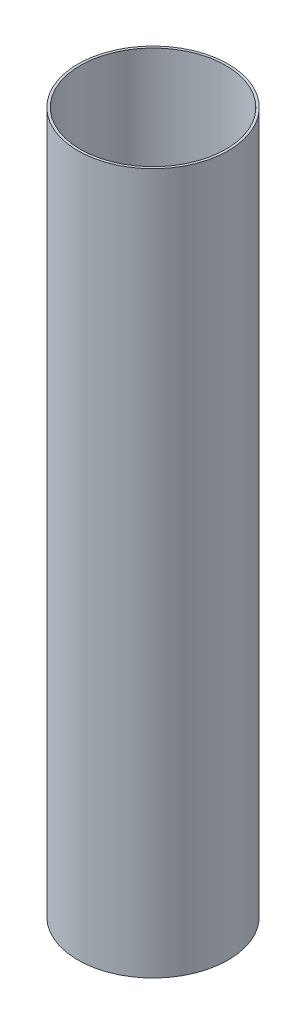
ISO-10303-21;
HEADER;
FILE_DESCRIPTION(('STEP AP214'),'2;1');
FILE_NAME('part.step','',(''),(''),'','','');
FILE_SCHEMA(('AUTOMOTIVE_DESIGN { 1 0 10303 214 1 1 1 1 }'));
ENDSEC;
DATA;
#1=APPLICATION_CONTEXT('core data for automotive mechanical design processes');
#2=APPLICATION_PROTOCOL_DEFINITION('international standard','automotive_design',2000,#1);
#3=PRODUCT_CONTEXT('',#1,'mechanical');
#4=PRODUCT('Part','Part','',(#3));
#5=PRODUCT_RELATED_PRODUCT_CATEGORY('part','',(#4));
#6=PRODUCT_DEFINITION_FORMATION('','',#4);
#7=PRODUCT_DEFINITION_CONTEXT('part definition',#1,'design');
#8=PRODUCT_DEFINITION('design','',#6,#7);
#9=PRODUCT_DEFINITION_SHAPE('','',#8);
#10=(LENGTH_UNIT() NAMED_UNIT(*) SI_UNIT(.MILLI.,.METRE.));
#11=(NAMED_UNIT(*) PLANE_ANGLE_UNIT() SI_UNIT($,.RADIAN.));
#12=(NAMED_UNIT(*) SI_UNIT($,.STERADIAN.) SOLID_ANGLE_UNIT());
#13=UNCERTAINTY_MEASURE_WITH_UNIT(LENGTH_MEASURE(1.E-05),#10,'distance_accuracy_value','');
#14=(GEOMETRIC_REPRESENTATION_CONTEXT(3) GLOBAL_UNCERTAINTY_ASSIGNED_CONTEXT((#13)) GLOBAL_UNIT_ASSIGNED_CONTEXT((#10,
#11,#12)) REPRESENTATION_CONTEXT('',''));
#15=CARTESIAN_POINT('',(0.,0.,0.));
#16=DIRECTION('',(0.,0.,1.));
#17=DIRECTION('',(1.,0.,0.));
#18=AXIS2_PLACEMENT_3D('',#15,#16,#17);
#19=CARTESIAN_POINT('',(0.,948.69,0.));
#20=DIRECTION('',(0.,1.,0.));
#21=DIRECTION('',(0.,0.,1.));
#22=AXIS2_PLACEMENT_3D('',#19,#20,#21);
#23=PLANE('',#22);
#24=CARTESIAN_POINT('',(0.,948.69,0.));
#25=DIRECTION('',(0.,1.,0.));
#26=DIRECTION('',(1.,0.,0.));
#27=AXIS2_PLACEMENT_3D('',#24,#25,#26);
#28=CIRCLE('',#27,101.727);
#29=CARTESIAN_POINT('',(101.727,948.69,0.));
#30=VERTEX_POINT('',#29);
#31=EDGE_CURVE('E11',#30,#30,#28,.T.);
#32=ORIENTED_EDGE('',*,*,#31,.T.);
#33=EDGE_LOOP('',(#32));
#34=FACE_BOUND('',#33,.T.);
#35=CARTESIAN_POINT('',(0.,948.69,0.));
#36=DIRECTION('',(0.,1.,0.));
#37=DIRECTION('',(0.,0.,1.));
#38=AXIS2_PLACEMENT_3D('',#35,#36,#37);
#39=CIRCLE('',#38,98.425);
#40=CARTESIAN_POINT('',(0.,948.69,98.425));
#41=VERTEX_POINT('',#40);
#42=EDGE_CURVE('E54',#41,#41,#39,.T.);
#43=ORIENTED_EDGE('',*,*,#42,.F.);
#44=EDGE_LOOP('',(#43));
#45=FACE_BOUND('',#44,.T.);
#46=ADVANCED_FACE('F43',(#34,#45),#23,.T.);
#47=CARTESIAN_POINT('',(0.,0.,0.));
#48=DIRECTION('',(0.,1.,0.));
#49=DIRECTION('',(0.,0.,1.));
#50=AXIS2_PLACEMENT_3D('',#47,#48,#49);
#51=PLANE('',#50);
#52=CARTESIAN_POINT('',(0.,0.,0.));
#53=DIRECTION('',(0.,1.,0.));
#54=DIRECTION('',(1.,0.,0.));
#55=AXIS2_PLACEMENT_3D('',#52,#53,#54);
#56=CIRCLE('',#55,101.727);
#57=CARTESIAN_POINT('',(101.727,0.,0.));
#58=VERTEX_POINT('',#57);
#59=EDGE_CURVE('E47',#58,#58,#56,.T.);
#60=ORIENTED_EDGE('',*,*,#59,.F.);
#61=EDGE_LOOP('',(#60));
#62=FACE_BOUND('',#61,.T.);
#63=CARTESIAN_POINT('',(0.,0.,0.));
#64=DIRECTION('',(0.,1.,0.));
#65=DIRECTION('',(0.,0.,1.));
#66=AXIS2_PLACEMENT_3D('',#63,#64,#65);
#67=CIRCLE('',#66,98.425);
#68=CARTESIAN_POINT('',(0.,0.,98.425));
#69=VERTEX_POINT('',#68);
#70=EDGE_CURVE('E56',#69,#69,#67,.T.);
#71=ORIENTED_EDGE('',*,*,#70,.T.);
#72=EDGE_LOOP('',(#71));
#73=FACE_BOUND('',#72,.T.);
#74=ADVANCED_FACE('F66',(#62,#73),#51,.F.);
#75=CARTESIAN_POINT('',(0.,948.69,0.));
#76=DIRECTION('',(0.,-1.,0.));
#77=DIRECTION('',(0.,0.,-1.));
#78=AXIS2_PLACEMENT_3D('',#75,#76,#77);
#79=CYLINDRICAL_SURFACE('',#78,101.727);
#80=ORIENTED_EDGE('',*,*,#31,.F.);
#81=EDGE_LOOP('',(#80));
#82=FACE_BOUND('',#81,.T.);
#83=ORIENTED_EDGE('',*,*,#59,.T.);
#84=EDGE_LOOP('',(#83));
#85=FACE_BOUND('',#84,.T.);
#86=ADVANCED_FACE('F45',(#82,#85),#79,.T.);
#87=CARTESIAN_POINT('',(0.,948.69,0.));
#88=DIRECTION('',(0.,-1.,0.));
#89=DIRECTION('',(0.,0.,-1.));
#90=AXIS2_PLACEMENT_3D('',#87,#88,#89);
#91=CYLINDRICAL_SURFACE('',#90,98.425);
#92=ORIENTED_EDGE('',*,*,#42,.T.);
#93=EDGE_LOOP('',(#92));
#94=FACE_BOUND('',#93,.T.);
#95=ORIENTED_EDGE('',*,*,#70,.F.);
#96=EDGE_LOOP('',(#95));
#97=FACE_BOUND('',#96,.T.);
#98=ADVANCED_FACE('F62',(#94,#97),#91,.F.);
#99=CLOSED_SHELL('',(#46,#74,#86,#98));
#100=MANIFOLD_SOLID_BREP('B2',#99);
#101=ADVANCED_BREP_SHAPE_REPRESENTATION('',(#18,#100),#14);
#102=SHAPE_DEFINITION_REPRESENTATION(#9,#101);
ENDSEC;
END-ISO-10303-21;
